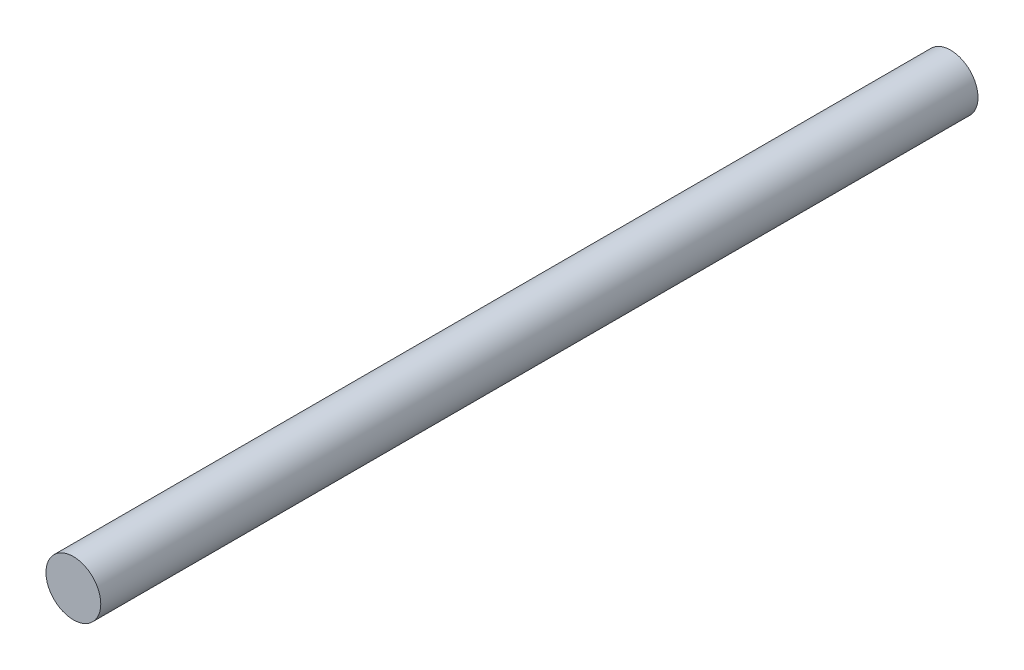
ISO-10303-21;
HEADER;
FILE_DESCRIPTION(('STEP AP214'),'2;1');
FILE_NAME('part.step','',(''),(''),'','','');
FILE_SCHEMA(('AUTOMOTIVE_DESIGN { 1 0 10303 214 1 1 1 1 }'));
ENDSEC;
DATA;
#1=APPLICATION_CONTEXT('core data for automotive mechanical design processes');
#2=APPLICATION_PROTOCOL_DEFINITION('international standard','automotive_design',2000,#1);
#3=PRODUCT_CONTEXT('',#1,'mechanical');
#4=PRODUCT('Part','Part','',(#3));
#5=PRODUCT_RELATED_PRODUCT_CATEGORY('part','',(#4));
#6=PRODUCT_DEFINITION_FORMATION('','',#4);
#7=PRODUCT_DEFINITION_CONTEXT('part definition',#1,'design');
#8=PRODUCT_DEFINITION('design','',#6,#7);
#9=PRODUCT_DEFINITION_SHAPE('','',#8);
#10=(LENGTH_UNIT() NAMED_UNIT(*) SI_UNIT(.MILLI.,.METRE.));
#11=(NAMED_UNIT(*) PLANE_ANGLE_UNIT() SI_UNIT($,.RADIAN.));
#12=(NAMED_UNIT(*) SI_UNIT($,.STERADIAN.) SOLID_ANGLE_UNIT());
#13=UNCERTAINTY_MEASURE_WITH_UNIT(LENGTH_MEASURE(1.E-05),#10,'distance_accuracy_value','');
#14=(GEOMETRIC_REPRESENTATION_CONTEXT(3) GLOBAL_UNCERTAINTY_ASSIGNED_CONTEXT((#13)) GLOBAL_UNIT_ASSIGNED_CONTEXT((#10,
#11,#12)) REPRESENTATION_CONTEXT('',''));
#15=CARTESIAN_POINT('',(0.,0.,0.));
#16=DIRECTION('',(0.,0.,1.));
#17=DIRECTION('',(1.,0.,0.));
#18=AXIS2_PLACEMENT_3D('',#15,#16,#17);
#19=CARTESIAN_POINT('',(-45.9250112037023,-30.3904613556178,160.));
#20=DIRECTION('',(0.,0.,-1.));
#21=DIRECTION('',(-1.,0.,0.));
#22=AXIS2_PLACEMENT_3D('',#19,#20,#21);
#23=CYLINDRICAL_SURFACE('',#22,5.);
#24=CARTESIAN_POINT('',(-45.9250112037023,-30.3904613556178,160.));
#25=DIRECTION('',(0.,0.,1.));
#26=DIRECTION('',(1.,0.,0.));
#27=AXIS2_PLACEMENT_3D('',#24,#25,#26);
#28=CIRCLE('',#27,5.);
#29=CARTESIAN_POINT('',(-40.9250112037023,-30.3904613556178,160.));
#30=VERTEX_POINT('',#29);
#31=EDGE_CURVE('E10',#30,#30,#28,.T.);
#32=ORIENTED_EDGE('',*,*,#31,.F.);
#33=EDGE_LOOP('',(#32));
#34=FACE_BOUND('',#33,.T.);
#35=CARTESIAN_POINT('',(-45.9250112037023,-30.3904613556178,0.));
#36=DIRECTION('',(0.,0.,1.));
#37=DIRECTION('',(1.,0.,0.));
#38=AXIS2_PLACEMENT_3D('',#35,#36,#37);
#39=CIRCLE('',#38,5.);
#40=CARTESIAN_POINT('',(-40.9250112037023,-30.3904613556178,0.));
#41=VERTEX_POINT('',#40);
#42=EDGE_CURVE('E34',#41,#41,#39,.T.);
#43=ORIENTED_EDGE('',*,*,#42,.T.);
#44=EDGE_LOOP('',(#43));
#45=FACE_BOUND('',#44,.T.);
#46=ADVANCED_FACE('F31',(#34,#45),#23,.T.);
#47=CARTESIAN_POINT('',(-45.9250112037023,-30.3904613556178,160.));
#48=DIRECTION('',(0.,0.,1.));
#49=DIRECTION('',(1.,0.,0.));
#50=AXIS2_PLACEMENT_3D('',#47,#48,#49);
#51=PLANE('',#50);
#52=ORIENTED_EDGE('',*,*,#31,.T.);
#53=EDGE_LOOP('',(#52));
#54=FACE_BOUND('',#53,.T.);
#55=ADVANCED_FACE('F46',(#54),#51,.T.);
#56=CARTESIAN_POINT('',(-45.9250112037023,-30.3904613556178,0.));
#57=DIRECTION('',(0.,0.,1.));
#58=DIRECTION('',(1.,0.,0.));
#59=AXIS2_PLACEMENT_3D('',#56,#57,#58);
#60=PLANE('',#59);
#61=ORIENTED_EDGE('',*,*,#42,.F.);
#62=EDGE_LOOP('',(#61));
#63=FACE_BOUND('',#62,.T.);
#64=ADVANCED_FACE('F44',(#63),#60,.F.);
#65=CLOSED_SHELL('',(#46,#55,#64));
#66=MANIFOLD_SOLID_BREP('B2',#65);
#67=ADVANCED_BREP_SHAPE_REPRESENTATION('',(#18,#66),#14);
#68=SHAPE_DEFINITION_REPRESENTATION(#9,#67);
ENDSEC;
END-ISO-10303-21;
